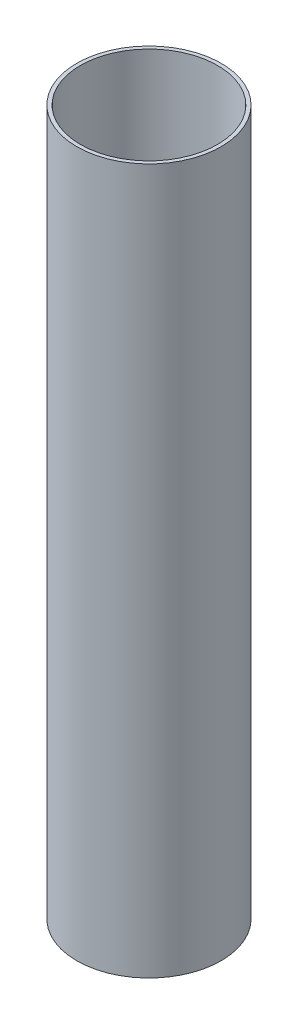
ISO-10303-21;
HEADER;
FILE_DESCRIPTION(('STEP AP214'),'2;1');
FILE_NAME('part.step','',(''),(''),'','','');
FILE_SCHEMA(('AUTOMOTIVE_DESIGN { 1 0 10303 214 1 1 1 1 }'));
ENDSEC;
DATA;
#1=APPLICATION_CONTEXT('core data for automotive mechanical design processes');
#2=APPLICATION_PROTOCOL_DEFINITION('international standard','automotive_design',2000,#1);
#3=PRODUCT_CONTEXT('',#1,'mechanical');
#4=PRODUCT('Part','Part','',(#3));
#5=PRODUCT_RELATED_PRODUCT_CATEGORY('part','',(#4));
#6=PRODUCT_DEFINITION_FORMATION('','',#4);
#7=PRODUCT_DEFINITION_CONTEXT('part definition',#1,'design');
#8=PRODUCT_DEFINITION('design','',#6,#7);
#9=PRODUCT_DEFINITION_SHAPE('','',#8);
#10=(LENGTH_UNIT() NAMED_UNIT(*) SI_UNIT(.MILLI.,.METRE.));
#11=(NAMED_UNIT(*) PLANE_ANGLE_UNIT() SI_UNIT($,.RADIAN.));
#12=(NAMED_UNIT(*) SI_UNIT($,.STERADIAN.) SOLID_ANGLE_UNIT());
#13=UNCERTAINTY_MEASURE_WITH_UNIT(LENGTH_MEASURE(1.E-05),#10,'distance_accuracy_value','');
#14=(GEOMETRIC_REPRESENTATION_CONTEXT(3) GLOBAL_UNCERTAINTY_ASSIGNED_CONTEXT((#13)) GLOBAL_UNIT_ASSIGNED_CONTEXT((#10,
#11,#12)) REPRESENTATION_CONTEXT('',''));
#15=CARTESIAN_POINT('',(0.,0.,0.));
#16=DIRECTION('',(0.,0.,1.));
#17=DIRECTION('',(1.,0.,0.));
#18=AXIS2_PLACEMENT_3D('',#15,#16,#17);
#19=CARTESIAN_POINT('',(0.,457.2,0.));
#20=DIRECTION('',(0.,1.,0.));
#21=DIRECTION('',(0.,0.,1.));
#22=AXIS2_PLACEMENT_3D('',#19,#20,#21);
#23=PLANE('',#22);
#24=CARTESIAN_POINT('',(0.,457.2,0.));
#25=DIRECTION('',(0.,1.,0.));
#26=DIRECTION('',(0.,0.,1.));
#27=AXIS2_PLACEMENT_3D('',#24,#25,#26);
#28=CIRCLE('',#27,93.6625);
#29=CARTESIAN_POINT('',(0.,457.2,93.6625));
#30=VERTEX_POINT('',#29);
#31=EDGE_CURVE('E10',#30,#30,#28,.T.);
#32=ORIENTED_EDGE('',*,*,#31,.T.);
#33=EDGE_LOOP('',(#32));
#34=FACE_BOUND('',#33,.T.);
#35=CARTESIAN_POINT('',(0.,457.2,0.));
#36=DIRECTION('',(0.,1.,0.));
#37=DIRECTION('',(0.,0.,1.));
#38=AXIS2_PLACEMENT_3D('',#35,#36,#37);
#39=CIRCLE('',#38,88.9);
#40=CARTESIAN_POINT('',(0.,457.2,88.9));
#41=VERTEX_POINT('',#40);
#42=EDGE_CURVE('E42',#41,#41,#39,.T.);
#43=ORIENTED_EDGE('',*,*,#42,.F.);
#44=EDGE_LOOP('',(#43));
#45=FACE_BOUND('',#44,.T.);
#46=ADVANCED_FACE('F31',(#34,#45),#23,.T.);
#47=CARTESIAN_POINT('',(0.,-457.2,0.));
#48=DIRECTION('',(0.,1.,0.));
#49=DIRECTION('',(0.,0.,1.));
#50=AXIS2_PLACEMENT_3D('',#47,#48,#49);
#51=PLANE('',#50);
#52=CARTESIAN_POINT('',(0.,-457.2,0.));
#53=DIRECTION('',(0.,1.,0.));
#54=DIRECTION('',(0.,0.,1.));
#55=AXIS2_PLACEMENT_3D('',#52,#53,#54);
#56=CIRCLE('',#55,93.6625);
#57=CARTESIAN_POINT('',(0.,-457.2,93.6625));
#58=VERTEX_POINT('',#57);
#59=EDGE_CURVE('E35',#58,#58,#56,.T.);
#60=ORIENTED_EDGE('',*,*,#59,.F.);
#61=EDGE_LOOP('',(#60));
#62=FACE_BOUND('',#61,.T.);
#63=CARTESIAN_POINT('',(0.,-457.2,0.));
#64=DIRECTION('',(0.,1.,0.));
#65=DIRECTION('',(0.,0.,1.));
#66=AXIS2_PLACEMENT_3D('',#63,#64,#65);
#67=CIRCLE('',#66,88.9);
#68=CARTESIAN_POINT('',(0.,-457.2,88.9));
#69=VERTEX_POINT('',#68);
#70=EDGE_CURVE('E44',#69,#69,#67,.T.);
#71=ORIENTED_EDGE('',*,*,#70,.T.);
#72=EDGE_LOOP('',(#71));
#73=FACE_BOUND('',#72,.T.);
#74=ADVANCED_FACE('F54',(#62,#73),#51,.F.);
#75=CARTESIAN_POINT('',(0.,457.2,0.));
#76=DIRECTION('',(0.,-1.,0.));
#77=DIRECTION('',(0.,0.,-1.));
#78=AXIS2_PLACEMENT_3D('',#75,#76,#77);
#79=CYLINDRICAL_SURFACE('',#78,93.6625);
#80=ORIENTED_EDGE('',*,*,#31,.F.);
#81=EDGE_LOOP('',(#80));
#82=FACE_BOUND('',#81,.T.);
#83=ORIENTED_EDGE('',*,*,#59,.T.);
#84=EDGE_LOOP('',(#83));
#85=FACE_BOUND('',#84,.T.);
#86=ADVANCED_FACE('F33',(#82,#85),#79,.T.);
#87=CARTESIAN_POINT('',(0.,457.2,0.));
#88=DIRECTION('',(0.,-1.,0.));
#89=DIRECTION('',(0.,0.,-1.));
#90=AXIS2_PLACEMENT_3D('',#87,#88,#89);
#91=CYLINDRICAL_SURFACE('',#90,88.9);
#92=ORIENTED_EDGE('',*,*,#42,.T.);
#93=EDGE_LOOP('',(#92));
#94=FACE_BOUND('',#93,.T.);
#95=ORIENTED_EDGE('',*,*,#70,.F.);
#96=EDGE_LOOP('',(#95));
#97=FACE_BOUND('',#96,.T.);
#98=ADVANCED_FACE('F50',(#94,#97),#91,.F.);
#99=CLOSED_SHELL('',(#46,#74,#86,#98));
#100=MANIFOLD_SOLID_BREP('B2',#99);
#101=ADVANCED_BREP_SHAPE_REPRESENTATION('',(#18,#100),#14);
#102=SHAPE_DEFINITION_REPRESENTATION(#9,#101);
ENDSEC;
END-ISO-10303-21;
